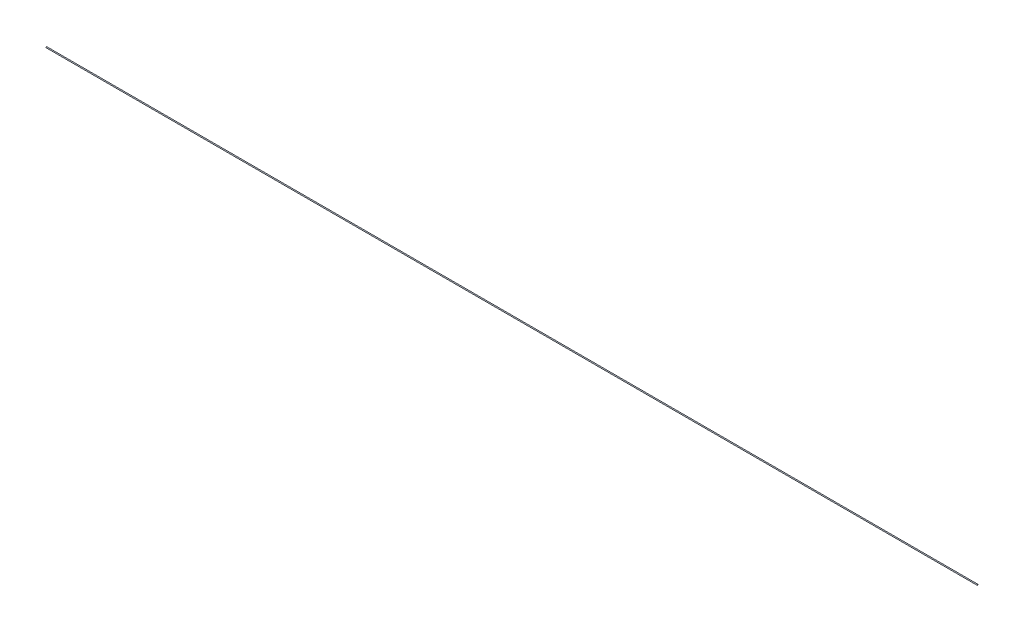
ISO-10303-21;
HEADER;
FILE_DESCRIPTION(('STEP AP214'),'2;1');
FILE_NAME('part.step','',(''),(''),'','','');
FILE_SCHEMA(('AUTOMOTIVE_DESIGN { 1 0 10303 214 1 1 1 1 }'));
ENDSEC;
DATA;
#1=APPLICATION_CONTEXT('core data for automotive mechanical design processes');
#2=APPLICATION_PROTOCOL_DEFINITION('international standard','automotive_design',2000,#1);
#3=PRODUCT_CONTEXT('',#1,'mechanical');
#4=PRODUCT('Part','Part','',(#3));
#5=PRODUCT_RELATED_PRODUCT_CATEGORY('part','',(#4));
#6=PRODUCT_DEFINITION_FORMATION('','',#4);
#7=PRODUCT_DEFINITION_CONTEXT('part definition',#1,'design');
#8=PRODUCT_DEFINITION('design','',#6,#7);
#9=PRODUCT_DEFINITION_SHAPE('','',#8);
#10=(LENGTH_UNIT() NAMED_UNIT(*) SI_UNIT(.MILLI.,.METRE.));
#11=(NAMED_UNIT(*) PLANE_ANGLE_UNIT() SI_UNIT($,.RADIAN.));
#12=(NAMED_UNIT(*) SI_UNIT($,.STERADIAN.) SOLID_ANGLE_UNIT());
#13=UNCERTAINTY_MEASURE_WITH_UNIT(LENGTH_MEASURE(1.E-05),#10,'distance_accuracy_value','');
#14=(GEOMETRIC_REPRESENTATION_CONTEXT(3) GLOBAL_UNCERTAINTY_ASSIGNED_CONTEXT((#13)) GLOBAL_UNIT_ASSIGNED_CONTEXT((#10,
#11,#12)) REPRESENTATION_CONTEXT('',''));
#15=CARTESIAN_POINT('',(0.,0.,0.));
#16=DIRECTION('',(0.,0.,1.));
#17=DIRECTION('',(1.,0.,0.));
#18=AXIS2_PLACEMENT_3D('',#15,#16,#17);
#19=CARTESIAN_POINT('',(260.,0.,0.));
#20=DIRECTION('',(-1.,0.,0.));
#21=DIRECTION('',(0.,0.,1.));
#22=AXIS2_PLACEMENT_3D('',#19,#20,#21);
#23=CYLINDRICAL_SURFACE('',#22,0.127);
#24=CARTESIAN_POINT('',(260.,0.,0.));
#25=DIRECTION('',(1.,0.,0.));
#26=DIRECTION('',(0.,0.,-1.));
#27=AXIS2_PLACEMENT_3D('',#24,#25,#26);
#28=CIRCLE('',#27,0.127);
#29=CARTESIAN_POINT('',(260.,0.,-0.127));
#30=VERTEX_POINT('',#29);
#31=EDGE_CURVE('E10',#30,#30,#28,.T.);
#32=ORIENTED_EDGE('',*,*,#31,.F.);
#33=EDGE_LOOP('',(#32));
#34=FACE_BOUND('',#33,.T.);
#35=CARTESIAN_POINT('',(0.,0.,0.));
#36=DIRECTION('',(1.,0.,0.));
#37=DIRECTION('',(0.,0.,-1.));
#38=AXIS2_PLACEMENT_3D('',#35,#36,#37);
#39=CIRCLE('',#38,0.127);
#40=CARTESIAN_POINT('',(0.,0.,-0.127));
#41=VERTEX_POINT('',#40);
#42=EDGE_CURVE('E36',#41,#41,#39,.T.);
#43=ORIENTED_EDGE('',*,*,#42,.T.);
#44=EDGE_LOOP('',(#43));
#45=FACE_BOUND('',#44,.T.);
#46=ADVANCED_FACE('F33',(#34,#45),#23,.T.);
#47=CARTESIAN_POINT('',(260.,0.,0.));
#48=DIRECTION('',(1.,0.,0.));
#49=DIRECTION('',(0.,0.,-1.));
#50=AXIS2_PLACEMENT_3D('',#47,#48,#49);
#51=PLANE('',#50);
#52=ORIENTED_EDGE('',*,*,#31,.T.);
#53=EDGE_LOOP('',(#52));
#54=FACE_BOUND('',#53,.T.);
#55=ADVANCED_FACE('F48',(#54),#51,.T.);
#56=CARTESIAN_POINT('',(0.,0.,0.));
#57=DIRECTION('',(1.,0.,0.));
#58=DIRECTION('',(0.,0.,-1.));
#59=AXIS2_PLACEMENT_3D('',#56,#57,#58);
#60=PLANE('',#59);
#61=ORIENTED_EDGE('',*,*,#42,.F.);
#62=EDGE_LOOP('',(#61));
#63=FACE_BOUND('',#62,.T.);
#64=ADVANCED_FACE('F46',(#63),#60,.F.);
#65=CLOSED_SHELL('',(#46,#55,#64));
#66=MANIFOLD_SOLID_BREP('B2',#65);
#67=ADVANCED_BREP_SHAPE_REPRESENTATION('',(#18,#66),#14);
#68=SHAPE_DEFINITION_REPRESENTATION(#9,#67);
ENDSEC;
END-ISO-10303-21;
